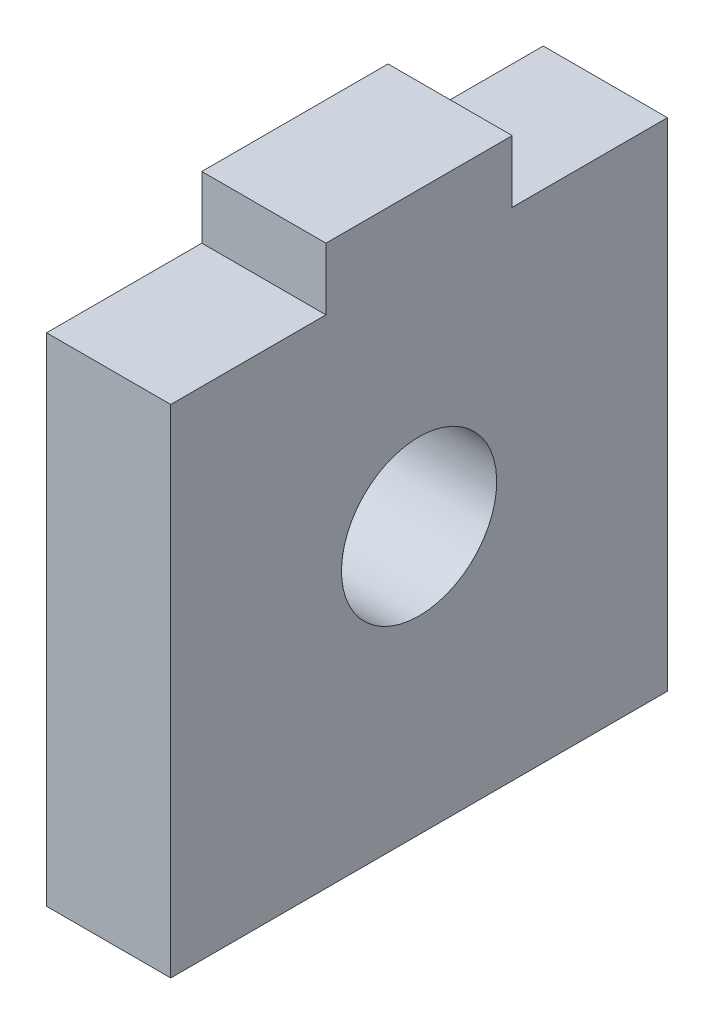
ISO-10303-21;
HEADER;
FILE_DESCRIPTION(('STEP AP214'),'2;1');
FILE_NAME('part.step','',(''),(''),'','','');
FILE_SCHEMA(('AUTOMOTIVE_DESIGN { 1 0 10303 214 1 1 1 1 }'));
ENDSEC;
DATA;
#1=APPLICATION_CONTEXT('core data for automotive mechanical design processes');
#2=APPLICATION_PROTOCOL_DEFINITION('international standard','automotive_design',2000,#1);
#3=PRODUCT_CONTEXT('',#1,'mechanical');
#4=PRODUCT('Part','Part','',(#3));
#5=PRODUCT_RELATED_PRODUCT_CATEGORY('part','',(#4));
#6=PRODUCT_DEFINITION_FORMATION('','',#4);
#7=PRODUCT_DEFINITION_CONTEXT('part definition',#1,'design');
#8=PRODUCT_DEFINITION('design','',#6,#7);
#9=PRODUCT_DEFINITION_SHAPE('','',#8);
#10=(LENGTH_UNIT() NAMED_UNIT(*) SI_UNIT(.MILLI.,.METRE.));
#11=(NAMED_UNIT(*) PLANE_ANGLE_UNIT() SI_UNIT($,.RADIAN.));
#12=(NAMED_UNIT(*) SI_UNIT($,.STERADIAN.) SOLID_ANGLE_UNIT());
#13=UNCERTAINTY_MEASURE_WITH_UNIT(LENGTH_MEASURE(1.E-05),#10,'distance_accuracy_value','');
#14=(GEOMETRIC_REPRESENTATION_CONTEXT(3) GLOBAL_UNCERTAINTY_ASSIGNED_CONTEXT((#13)) GLOBAL_UNIT_ASSIGNED_CONTEXT((#10,
#11,#12)) REPRESENTATION_CONTEXT('',''));
#15=CARTESIAN_POINT('',(0.,0.,0.));
#16=DIRECTION('',(0.,0.,1.));
#17=DIRECTION('',(1.,0.,0.));
#18=AXIS2_PLACEMENT_3D('',#15,#16,#17);
#19=CARTESIAN_POINT('',(0.,0.,-7.5));
#20=DIRECTION('',(0.,0.,1.));
#21=DIRECTION('',(0.,1.,0.));
#22=AXIS2_PLACEMENT_3D('',#19,#20,#21);
#23=PLANE('',#22);
#24=DIRECTION('',(1.,0.,0.));
#25=VECTOR('',#24,1.);
#26=CARTESIAN_POINT('',(0.,0.,-7.5));
#27=LINE('',#26,#25);
#28=CARTESIAN_POINT('',(-10.,0.,-7.5));
#29=VERTEX_POINT('',#28);
#30=CARTESIAN_POINT('',(0.,0.,-7.5));
#31=VERTEX_POINT('',#30);
#32=EDGE_CURVE('E11',#29,#31,#27,.T.);
#33=ORIENTED_EDGE('',*,*,#32,.F.);
#34=DIRECTION('',(0.,-1.,0.));
#35=VECTOR('',#34,1.);
#36=CARTESIAN_POINT('',(-10.,0.,-7.5));
#37=LINE('',#36,#35);
#38=CARTESIAN_POINT('',(-10.,5.,-7.5));
#39=VERTEX_POINT('',#38);
#40=EDGE_CURVE('E104',#29,#39,#37,.F.);
#41=ORIENTED_EDGE('',*,*,#40,.T.);
#42=DIRECTION('',(1.,0.,0.));
#43=VECTOR('',#42,1.);
#44=CARTESIAN_POINT('',(0.,5.,-7.5));
#45=LINE('',#44,#43);
#46=CARTESIAN_POINT('',(0.,5.,-7.5));
#47=VERTEX_POINT('',#46);
#48=EDGE_CURVE('E46',#39,#47,#45,.T.);
#49=ORIENTED_EDGE('',*,*,#48,.T.);
#50=DIRECTION('',(0.,1.,0.));
#51=VECTOR('',#50,1.);
#52=CARTESIAN_POINT('',(0.,0.,-7.5));
#53=LINE('',#52,#51);
#54=EDGE_CURVE('E145',#31,#47,#53,.T.);
#55=ORIENTED_EDGE('',*,*,#54,.F.);
#56=EDGE_LOOP('',(#33,#41,#49,#55));
#57=FACE_BOUND('',#56,.T.);
#58=ADVANCED_FACE('F37',(#57),#23,.F.);
#59=CARTESIAN_POINT('',(0.,5.,7.5));
#60=DIRECTION('',(0.,-1.,0.));
#61=DIRECTION('',(0.,0.,1.));
#62=AXIS2_PLACEMENT_3D('',#59,#60,#61);
#63=PLANE('',#62);
#64=ORIENTED_EDGE('',*,*,#48,.F.);
#65=DIRECTION('',(0.,0.,1.));
#66=VECTOR('',#65,1.);
#67=CARTESIAN_POINT('',(-10.,5.,20.));
#68=LINE('',#67,#66);
#69=CARTESIAN_POINT('',(-10.,5.,7.5));
#70=VERTEX_POINT('',#69);
#71=EDGE_CURVE('E125',#39,#70,#68,.T.);
#72=ORIENTED_EDGE('',*,*,#71,.T.);
#73=DIRECTION('',(1.,0.,0.));
#74=VECTOR('',#73,1.);
#75=CARTESIAN_POINT('',(0.,5.,7.5));
#76=LINE('',#75,#74);
#77=CARTESIAN_POINT('',(0.,5.,7.5));
#78=VERTEX_POINT('',#77);
#79=EDGE_CURVE('E138',#70,#78,#76,.T.);
#80=ORIENTED_EDGE('',*,*,#79,.T.);
#81=DIRECTION('',(0.,0.,1.));
#82=VECTOR('',#81,1.);
#83=CARTESIAN_POINT('',(0.,5.,7.5));
#84=LINE('',#83,#82);
#85=EDGE_CURVE('E154',#47,#78,#84,.T.);
#86=ORIENTED_EDGE('',*,*,#85,.F.);
#87=EDGE_LOOP('',(#64,#72,#80,#86));
#88=FACE_BOUND('',#87,.T.);
#89=ADVANCED_FACE('F157',(#88),#63,.F.);
#90=CARTESIAN_POINT('',(0.,0.,7.5));
#91=DIRECTION('',(0.,0.,-1.));
#92=DIRECTION('',(0.,-1.,0.));
#93=AXIS2_PLACEMENT_3D('',#90,#91,#92);
#94=PLANE('',#93);
#95=ORIENTED_EDGE('',*,*,#79,.F.);
#96=DIRECTION('',(0.,-1.,0.));
#97=VECTOR('',#96,1.);
#98=CARTESIAN_POINT('',(-10.,0.,7.5));
#99=LINE('',#98,#97);
#100=CARTESIAN_POINT('',(-10.,0.,7.5));
#101=VERTEX_POINT('',#100);
#102=EDGE_CURVE('E122',#70,#101,#99,.T.);
#103=ORIENTED_EDGE('',*,*,#102,.T.);
#104=DIRECTION('',(1.,0.,0.));
#105=VECTOR('',#104,1.);
#106=CARTESIAN_POINT('',(0.,0.,7.5));
#107=LINE('',#106,#105);
#108=CARTESIAN_POINT('',(0.,0.,7.5));
#109=VERTEX_POINT('',#108);
#110=EDGE_CURVE('E135',#101,#109,#107,.T.);
#111=ORIENTED_EDGE('',*,*,#110,.T.);
#112=DIRECTION('',(0.,-1.,0.));
#113=VECTOR('',#112,1.);
#114=CARTESIAN_POINT('',(0.,0.,7.5));
#115=LINE('',#114,#113);
#116=EDGE_CURVE('E158',#78,#109,#115,.T.);
#117=ORIENTED_EDGE('',*,*,#116,.F.);
#118=EDGE_LOOP('',(#95,#103,#111,#117));
#119=FACE_BOUND('',#118,.T.);
#120=ADVANCED_FACE('F181',(#119),#94,.F.);
#121=CARTESIAN_POINT('',(0.,0.,20.));
#122=DIRECTION('',(0.,1.,0.));
#123=DIRECTION('',(0.,0.,-1.));
#124=AXIS2_PLACEMENT_3D('',#121,#122,#123);
#125=PLANE('',#124);
#126=ORIENTED_EDGE('',*,*,#110,.F.);
#127=DIRECTION('',(0.,0.,1.));
#128=VECTOR('',#127,1.);
#129=CARTESIAN_POINT('',(-10.,0.,20.));
#130=LINE('',#129,#128);
#131=CARTESIAN_POINT('',(-10.,0.,20.));
#132=VERTEX_POINT('',#131);
#133=EDGE_CURVE('E119',#132,#101,#130,.F.);
#134=ORIENTED_EDGE('',*,*,#133,.F.);
#135=DIRECTION('',(1.,0.,0.));
#136=VECTOR('',#135,1.);
#137=CARTESIAN_POINT('',(0.,0.,20.));
#138=LINE('',#137,#136);
#139=CARTESIAN_POINT('',(0.,0.,20.));
#140=VERTEX_POINT('',#139);
#141=EDGE_CURVE('E132',#132,#140,#138,.T.);
#142=ORIENTED_EDGE('',*,*,#141,.T.);
#143=DIRECTION('',(0.,0.,-1.));
#144=VECTOR('',#143,1.);
#145=CARTESIAN_POINT('',(0.,0.,20.));
#146=LINE('',#145,#144);
#147=EDGE_CURVE('E160',#140,#109,#146,.T.);
#148=ORIENTED_EDGE('',*,*,#147,.T.);
#149=EDGE_LOOP('',(#126,#134,#142,#148));
#150=FACE_BOUND('',#149,.T.);
#151=ADVANCED_FACE('F177',(#150),#125,.T.);
#152=CARTESIAN_POINT('',(0.,0.,20.));
#153=DIRECTION('',(0.,0.,1.));
#154=DIRECTION('',(0.,1.,0.));
#155=AXIS2_PLACEMENT_3D('',#152,#153,#154);
#156=PLANE('',#155);
#157=ORIENTED_EDGE('',*,*,#141,.F.);
#158=DIRECTION('',(0.,-1.,0.));
#159=VECTOR('',#158,1.);
#160=CARTESIAN_POINT('',(-10.,0.,20.));
#161=LINE('',#160,#159);
#162=CARTESIAN_POINT('',(-9.99999999999999,-40.,20.));
#163=VERTEX_POINT('',#162);
#164=EDGE_CURVE('E116',#163,#132,#161,.F.);
#165=ORIENTED_EDGE('',*,*,#164,.F.);
#166=DIRECTION('',(1.,0.,0.));
#167=VECTOR('',#166,1.);
#168=CARTESIAN_POINT('',(0.,-40.,20.));
#169=LINE('',#168,#167);
#170=CARTESIAN_POINT('',(0.,-40.,20.));
#171=VERTEX_POINT('',#170);
#172=EDGE_CURVE('E130',#163,#171,#169,.T.);
#173=ORIENTED_EDGE('',*,*,#172,.T.);
#174=DIRECTION('',(0.,1.,0.));
#175=VECTOR('',#174,1.);
#176=CARTESIAN_POINT('',(0.,0.,20.));
#177=LINE('',#176,#175);
#178=EDGE_CURVE('E164',#171,#140,#177,.T.);
#179=ORIENTED_EDGE('',*,*,#178,.T.);
#180=EDGE_LOOP('',(#157,#165,#173,#179));
#181=FACE_BOUND('',#180,.T.);
#182=ADVANCED_FACE('F173',(#181),#156,.T.);
#183=CARTESIAN_POINT('',(0.,-40.,20.));
#184=DIRECTION('',(0.,1.,0.));
#185=DIRECTION('',(0.,0.,-1.));
#186=AXIS2_PLACEMENT_3D('',#183,#184,#185);
#187=PLANE('',#186);
#188=ORIENTED_EDGE('',*,*,#172,.F.);
#189=DIRECTION('',(0.,0.,1.));
#190=VECTOR('',#189,1.);
#191=CARTESIAN_POINT('',(-9.99999999999999,-40.,20.));
#192=LINE('',#191,#190);
#193=CARTESIAN_POINT('',(-9.99999999999999,-40.,-20.));
#194=VERTEX_POINT('',#193);
#195=EDGE_CURVE('E113',#163,#194,#192,.F.);
#196=ORIENTED_EDGE('',*,*,#195,.T.);
#197=DIRECTION('',(1.,0.,0.));
#198=VECTOR('',#197,1.);
#199=CARTESIAN_POINT('',(0.,-40.,-20.));
#200=LINE('',#199,#198);
#201=CARTESIAN_POINT('',(0.,-40.,-20.));
#202=VERTEX_POINT('',#201);
#203=EDGE_CURVE('E54',#194,#202,#200,.T.);
#204=ORIENTED_EDGE('',*,*,#203,.T.);
#205=DIRECTION('',(0.,0.,-1.));
#206=VECTOR('',#205,1.);
#207=CARTESIAN_POINT('',(0.,-40.,20.));
#208=LINE('',#207,#206);
#209=EDGE_CURVE('E97',#171,#202,#208,.T.);
#210=ORIENTED_EDGE('',*,*,#209,.F.);
#211=EDGE_LOOP('',(#188,#196,#204,#210));
#212=FACE_BOUND('',#211,.T.);
#213=ADVANCED_FACE('F170',(#212),#187,.F.);
#214=CARTESIAN_POINT('',(0.,0.,-20.));
#215=DIRECTION('',(0.,0.,1.));
#216=DIRECTION('',(0.,1.,0.));
#217=AXIS2_PLACEMENT_3D('',#214,#215,#216);
#218=PLANE('',#217);
#219=ORIENTED_EDGE('',*,*,#203,.F.);
#220=DIRECTION('',(0.,-1.,0.));
#221=VECTOR('',#220,1.);
#222=CARTESIAN_POINT('',(-10.,0.,-20.));
#223=LINE('',#222,#221);
#224=CARTESIAN_POINT('',(-10.,0.,-20.));
#225=VERTEX_POINT('',#224);
#226=EDGE_CURVE('E102',#194,#225,#223,.F.);
#227=ORIENTED_EDGE('',*,*,#226,.T.);
#228=DIRECTION('',(1.,0.,0.));
#229=VECTOR('',#228,1.);
#230=CARTESIAN_POINT('',(0.,0.,-20.));
#231=LINE('',#230,#229);
#232=CARTESIAN_POINT('',(0.,0.,-20.));
#233=VERTEX_POINT('',#232);
#234=EDGE_CURVE('E40',#225,#233,#231,.T.);
#235=ORIENTED_EDGE('',*,*,#234,.T.);
#236=DIRECTION('',(0.,1.,0.));
#237=VECTOR('',#236,1.);
#238=CARTESIAN_POINT('',(0.,0.,-20.));
#239=LINE('',#238,#237);
#240=EDGE_CURVE('E168',#202,#233,#239,.T.);
#241=ORIENTED_EDGE('',*,*,#240,.F.);
#242=EDGE_LOOP('',(#219,#227,#235,#241));
#243=FACE_BOUND('',#242,.T.);
#244=ADVANCED_FACE('F106',(#243),#218,.F.);
#245=CARTESIAN_POINT('',(0.,-18.5,0.));
#246=DIRECTION('',(-1.,0.,0.));
#247=DIRECTION('',(0.,-1.,0.));
#248=AXIS2_PLACEMENT_3D('',#245,#246,#247);
#249=CYLINDRICAL_SURFACE('',#248,6.25);
#250=CARTESIAN_POINT('',(0.,-18.5,0.));
#251=DIRECTION('',(-1.,0.,0.));
#252=DIRECTION('',(0.,-1.,0.));
#253=AXIS2_PLACEMENT_3D('',#250,#251,#252);
#254=CIRCLE('',#253,6.25);
#255=CARTESIAN_POINT('',(0.,-24.75,0.));
#256=VERTEX_POINT('',#255);
#257=EDGE_CURVE('E115',#256,#256,#254,.T.);
#258=ORIENTED_EDGE('',*,*,#257,.F.);
#259=EDGE_LOOP('',(#258));
#260=FACE_BOUND('',#259,.T.);
#261=CARTESIAN_POINT('',(-10.,-18.5,0.));
#262=DIRECTION('',(-1.,0.,0.));
#263=DIRECTION('',(0.,-1.,0.));
#264=AXIS2_PLACEMENT_3D('',#261,#262,#263);
#265=CIRCLE('',#264,6.25);
#266=CARTESIAN_POINT('',(-10.,-24.75,0.));
#267=VERTEX_POINT('',#266);
#268=EDGE_CURVE('E107',#267,#267,#265,.T.);
#269=ORIENTED_EDGE('',*,*,#268,.T.);
#270=EDGE_LOOP('',(#269));
#271=FACE_BOUND('',#270,.T.);
#272=ADVANCED_FACE('F189',(#260,#271),#249,.F.);
#273=DIRECTION('',(0.,0.,1.));
#274=VECTOR('',#273,1.);
#275=CARTESIAN_POINT('',(-10.,0.,20.));
#276=LINE('',#275,#274);
#277=EDGE_CURVE('E91',#29,#225,#276,.F.);
#278=ORIENTED_EDGE('',*,*,#277,.F.);
#279=ORIENTED_EDGE('',*,*,#32,.T.);
#280=EDGE_CURVE('E93',#31,#233,#146,.T.);
#281=ORIENTED_EDGE('',*,*,#280,.T.);
#282=ORIENTED_EDGE('',*,*,#234,.F.);
#283=EDGE_LOOP('',(#278,#279,#281,#282));
#284=FACE_BOUND('',#283,.T.);
#285=ADVANCED_FACE('F90',(#284),#125,.T.);
#286=CARTESIAN_POINT('',(0.,0.,20.));
#287=DIRECTION('',(-1.,0.,0.));
#288=DIRECTION('',(0.,-1.,0.));
#289=AXIS2_PLACEMENT_3D('',#286,#287,#288);
#290=PLANE('',#289);
#291=ORIENTED_EDGE('',*,*,#257,.T.);
#292=EDGE_LOOP('',(#291));
#293=FACE_BOUND('',#292,.T.);
#294=ORIENTED_EDGE('',*,*,#240,.T.);
#295=ORIENTED_EDGE('',*,*,#280,.F.);
#296=ORIENTED_EDGE('',*,*,#54,.T.);
#297=ORIENTED_EDGE('',*,*,#85,.T.);
#298=ORIENTED_EDGE('',*,*,#116,.T.);
#299=ORIENTED_EDGE('',*,*,#147,.F.);
#300=ORIENTED_EDGE('',*,*,#178,.F.);
#301=ORIENTED_EDGE('',*,*,#209,.T.);
#302=EDGE_LOOP('',(#294,#295,#296,#297,#298,#299,#300,#301));
#303=FACE_BOUND('',#302,.T.);
#304=ADVANCED_FACE('F152',(#293,#303),#290,.F.);
#305=CARTESIAN_POINT('',(-10.,0.,20.));
#306=DIRECTION('',(-1.,0.,0.));
#307=DIRECTION('',(0.,-1.,0.));
#308=AXIS2_PLACEMENT_3D('',#305,#306,#307);
#309=PLANE('',#308);
#310=ORIENTED_EDGE('',*,*,#268,.F.);
#311=EDGE_LOOP('',(#310));
#312=FACE_BOUND('',#311,.T.);
#313=ORIENTED_EDGE('',*,*,#226,.F.);
#314=ORIENTED_EDGE('',*,*,#195,.F.);
#315=ORIENTED_EDGE('',*,*,#164,.T.);
#316=ORIENTED_EDGE('',*,*,#133,.T.);
#317=ORIENTED_EDGE('',*,*,#102,.F.);
#318=ORIENTED_EDGE('',*,*,#71,.F.);
#319=ORIENTED_EDGE('',*,*,#40,.F.);
#320=ORIENTED_EDGE('',*,*,#277,.T.);
#321=EDGE_LOOP('',(#313,#314,#315,#316,#317,#318,#319,#320));
#322=FACE_BOUND('',#321,.T.);
#323=ADVANCED_FACE('F100',(#312,#322),#309,.T.);
#324=CLOSED_SHELL('',(#58,#89,#120,#151,#182,#213,#244,#272,#285,#304,#323));
#325=MANIFOLD_SOLID_BREP('B2',#324);
#326=ADVANCED_BREP_SHAPE_REPRESENTATION('',(#18,#325),#14);
#327=SHAPE_DEFINITION_REPRESENTATION(#9,#326);
ENDSEC;
END-ISO-10303-21;
